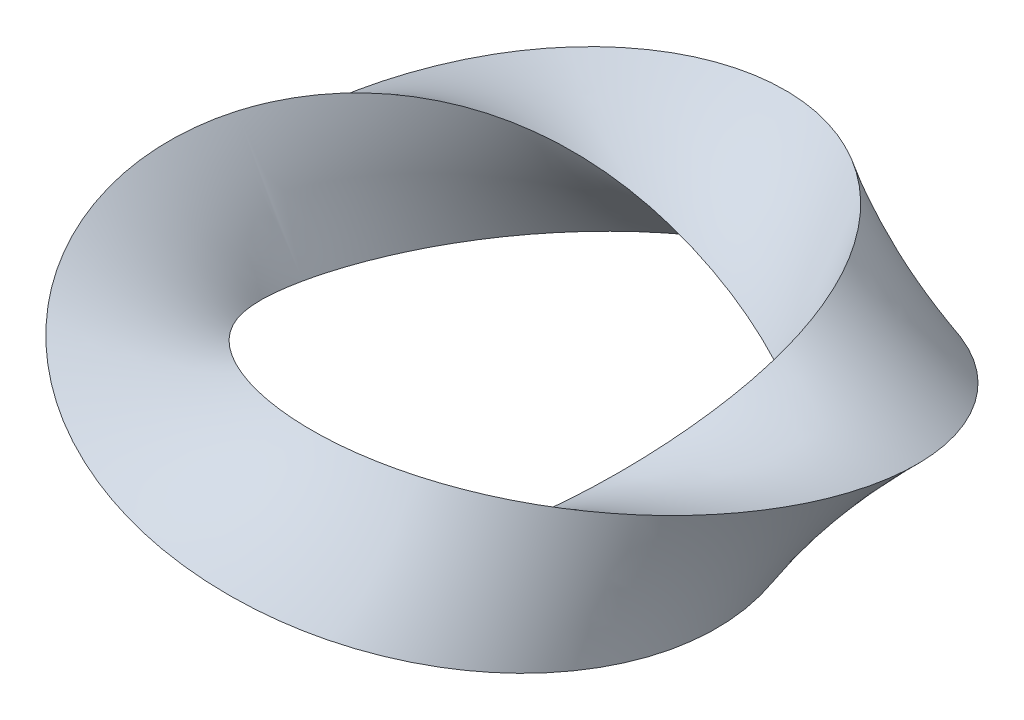
ISO-10303-21;
HEADER;
FILE_DESCRIPTION(('STEP AP214'),'2;1');
FILE_NAME('part.step','',(''),(''),'','','');
FILE_SCHEMA(('AUTOMOTIVE_DESIGN { 1 0 10303 214 1 1 1 1 }'));
ENDSEC;
DATA;
#1=APPLICATION_CONTEXT('core data for automotive mechanical design processes');
#2=APPLICATION_PROTOCOL_DEFINITION('international standard','automotive_design',2000,#1);
#3=PRODUCT_CONTEXT('',#1,'mechanical');
#4=PRODUCT('Part','Part','',(#3));
#5=PRODUCT_RELATED_PRODUCT_CATEGORY('part','',(#4));
#6=PRODUCT_DEFINITION_FORMATION('','',#4);
#7=PRODUCT_DEFINITION_CONTEXT('part definition',#1,'design');
#8=PRODUCT_DEFINITION('design','',#6,#7);
#9=PRODUCT_DEFINITION_SHAPE('','',#8);
#10=(LENGTH_UNIT() NAMED_UNIT(*) SI_UNIT(.MILLI.,.METRE.));
#11=(NAMED_UNIT(*) PLANE_ANGLE_UNIT() SI_UNIT($,.RADIAN.));
#12=(NAMED_UNIT(*) SI_UNIT($,.STERADIAN.) SOLID_ANGLE_UNIT());
#13=UNCERTAINTY_MEASURE_WITH_UNIT(LENGTH_MEASURE(1.E-05),#10,'distance_accuracy_value','');
#14=(GEOMETRIC_REPRESENTATION_CONTEXT(3) GLOBAL_UNCERTAINTY_ASSIGNED_CONTEXT((#13)) GLOBAL_UNIT_ASSIGNED_CONTEXT((#10,
#11,#12)) REPRESENTATION_CONTEXT('',''));
#15=CARTESIAN_POINT('',(0.,0.,0.));
#16=DIRECTION('',(0.,0.,1.));
#17=DIRECTION('',(1.,0.,0.));
#18=AXIS2_PLACEMENT_3D('',#15,#16,#17);
#19=CARTESIAN_POINT('',(-37.5,-4.33012701892219,0.));
#20=CARTESIAN_POINT('',(-36.9331876986768,-5.31187472316901,4.90873852123405));
#21=CARTESIAN_POINT('',(-35.1848968636041,-6.18053453575194,9.57655104048252));
#22=CARTESIAN_POINT('',(-29.9893137674932,-7.56074840163707,17.4194909198788));
#23=CARTESIAN_POINT('',(-26.5566893698285,-8.07175940025579,20.5881504869488));
#24=CARTESIAN_POINT('',(-19.0395904824421,-8.65856667450038,25.0081293653218));
#25=CARTESIAN_POINT('',(-14.9693914168101,-8.73413206677209,26.2642448082777));
#26=CARTESIAN_POINT('',(-7.12645148771719,-8.43819666125312,27.0798388038974));
#27=CARTESIAN_POINT('',(-3.36017840763648,-8.06681230123433,26.6516206846521));
#28=CARTESIAN_POINT('',(3.36017840763654,-6.93318769876564,24.6881252775034));
#29=CARTESIAN_POINT('',(6.31815324157185,-6.17139348863086,23.1649388714517));
#30=CARTESIAN_POINT('',(11.3842913807537,-4.37266375868246,19.5725430229252));
#31=CARTESIAN_POINT('',(13.5030858580376,-3.33643596123894,17.5081293968507));
#32=CARTESIAN_POINT('',(17.0931939942331,-1.14644139960124,13.0881504554199));
#33=CARTESIAN_POINT('',(18.5744138035498,0.00646369639998668,10.7277891975303));
#34=CARTESIAN_POINT('',(20.9931951097494,2.25431627003643,5.66165104503271));
#35=CARTESIAN_POINT('',(21.9331876990619,3.34837931485067,2.94524301827781));
#36=CARTESIAN_POINT('',(23.0668123009381,5.31187472299382,-2.94524301827782));
#37=CARTESIAN_POINT('',(23.2534636396127,6.18053453574113,-6.12832225505073));
#38=CARTESIAN_POINT('',(22.4378696306445,7.56074840164795,-12.7976476683988));
#39=CARTESIAN_POINT('',(21.4233209949543,8.07175940026838,-16.2846528906458));
#40=CARTESIAN_POINT('',(17.8332128951609,8.65856667448781,-22.9718809994693));
#41=CARTESIAN_POINT('',(15.247747171471,8.7341320667658,-26.1629385899118));
#42=CARTESIAN_POINT('',(8.57842180781251,8.4381966612594,-31.3585216992676));
#43=CARTESIAN_POINT('',(4.49380297309094,8.06681230122166,-33.3483793153453));
#44=CARTESIAN_POINT('',(-4.49380297309095,6.93318769877824,-35.3118747224993));
#45=CARTESIAN_POINT('',(-9.38672005392585,6.17139348865209,-35.2734216317438));
#46=CARTESIAN_POINT('',(-18.8328472075595,4.37266375866115,-32.8546403752338));
#47=CARTESIAN_POINT('',(-23.3697175195024,3.33643596125307,-30.4718809679666));
#48=CARTESIAN_POINT('',(-30.8868163706127,1.146441399587,-23.7846529221484));
#49=CARTESIAN_POINT('',(-33.8527695945879,-0.00646369638231939,-19.4893493908182));
#50=CARTESIAN_POINT('',(-37.4451653934674,-2.25431627005422,-10.0432222504294));
#51=CARTESIAN_POINT('',(-38.0668123013232,-3.34837931467538,-4.90873852123405));
#52=CARTESIAN_POINT('',(-37.5,-4.33012701892219,0.));
#53=CARTESIAN_POINT('',(-22.5,-4.33012701892219,0.));
#54=CARTESIAN_POINT('',(-21.9331876986768,-3.34837931467538,2.94524311274043));
#55=CARTESIAN_POINT('',(-20.993195109757,-2.25431627004797,5.66165104505008));
#56=CARTESIAN_POINT('',(-18.5744138035422,-0.00646369638831676,10.727789197513));
#57=CARTESIAN_POINT('',(-17.0931939941808,1.14644139960017,13.0881504554532));
#58=CARTESIAN_POINT('',(-13.5030858580899,3.33643596124013,17.5081293968174));
#59=CARTESIAN_POINT('',(-11.3842913807434,4.37266375866613,19.572543022935));
#60=CARTESIAN_POINT('',(-6.31815324158212,6.17139348864728,23.164938871442));
#61=CARTESIAN_POINT('',(-3.36017840763649,6.93318769877275,24.6881252775035));
#62=CARTESIAN_POINT('',(3.36017840763654,8.06681230122727,26.6516206846522));
#63=CARTESIAN_POINT('',(7.12645148770648,8.43819666125232,27.0798388039067));
#64=CARTESIAN_POINT('',(14.9693914168208,8.7341320667729,26.2642448082685));
#65=CARTESIAN_POINT('',(19.0395904823721,8.65856667448069,25.0081293653693));
#66=CARTESIAN_POINT('',(26.5566893698987,8.07175940027543,20.5881504869013));
#67=CARTESIAN_POINT('',(29.9893137674791,7.56074840163724,17.4194909199214));
#68=CARTESIAN_POINT('',(35.1848968636184,6.18053453575169,9.57655104043985));
#69=CARTESIAN_POINT('',(36.9331876990619,5.31187472299548,4.90873836245379));
#70=CARTESIAN_POINT('',(38.0668123009381,3.34837931484879,-4.9087383624538));
#71=CARTESIAN_POINT('',(37.4451653934532,2.25431627003276,-10.0432222504791));
#72=CARTESIAN_POINT('',(33.8527695946021,0.00646369640340365,-19.4893493907686));
#73=CARTESIAN_POINT('',(30.8868163706126,-1.14644139960136,-23.7846529221342));
#74=CARTESIAN_POINT('',(23.3697175195024,-3.33643596123906,-30.4718809679808));
#75=CARTESIAN_POINT('',(18.832847207524,-4.37266375866129,-32.854640375262));
#76=CARTESIAN_POINT('',(9.38672005396125,-6.17139348865223,-35.2734216317153));
#77=CARTESIAN_POINT('',(4.49380297309092,-6.93318769877833,-35.3118747224849));
#78=CARTESIAN_POINT('',(-4.49380297309092,-8.06681230122175,-33.3483793153593));
#79=CARTESIAN_POINT('',(-8.57842180779472,-8.43819666124524,-31.3585216993029));
#80=CARTESIAN_POINT('',(-15.2477471714887,-8.73413206678,-26.1629385898762));
#81=CARTESIAN_POINT('',(-17.8332128951608,-8.65856667448067,-22.971880999455));
#82=CARTESIAN_POINT('',(-21.4233209949541,-8.07175940027542,-16.2846528906598));
#83=CARTESIAN_POINT('',(-22.4378696306585,-7.56074840164252,-12.7976476684271));
#84=CARTESIAN_POINT('',(-23.2534636395984,-6.18053453574633,-6.12832225502227));
#85=CARTESIAN_POINT('',(-23.0668123013232,-5.311874723169,-2.94524311274043));
#86=CARTESIAN_POINT('',(-22.5,-4.33012701892219,0.));
#87=B_SPLINE_SURFACE_WITH_KNOTS('',1,3,((#19,#20,#21,#22,#23,#24,#25,#26,#27,#28,#29,#30,#31,
#32,#33,#34,#35,#36,#37,#38,#39,#40,#41,#42,#43,#44,#45,#46,#47,#48,#49,#50,#51,#52),(#53,#54,
#55,#56,#57,#58,#59,#60,#61,#62,#63,#64,#65,#66,#67,#68,#69,#70,#71,#72,#73,#74,#75,#76,#77,#78,
#79,#80,#81,#82,#83,#84,#85,#86)),.UNSPECIFIED.,.F.,.T.,.F.,(2,2),(4,2,2,2,2,2,2,2,2,2,2,2,2,2,
2,2,4),(0.,1.),(0.,0.0625,0.125,0.1875,0.25,0.3125,0.375,0.4375,0.5,0.5625,0.625,0.6875,0.75,
0.8125,0.875,0.9375,1.),.UNSPECIFIED.);
#88=DIRECTION('',(1.,0.,0.));
#89=VECTOR('',#88,1.);
#90=CARTESIAN_POINT('',(-37.5,-4.33012701892219,0.));
#91=LINE('',#90,#89);
#92=CARTESIAN_POINT('',(-37.5,-4.3301270189222,0.));
#93=VERTEX_POINT('',#92);
#94=CARTESIAN_POINT('',(-22.5,-4.33012701892219,0.));
#95=VERTEX_POINT('',#94);
#96=EDGE_CURVE('E40',#93,#95,#91,.T.);
#97=CARTESIAN_POINT('',(-37.5,-4.3301270189222,0.));
#98=CARTESIAN_POINT('',(-36.9331876986768,-5.31187472316901,4.90873852123405));
#99=CARTESIAN_POINT('',(-35.1848968636041,-6.18053453575195,9.57655104048252));
#100=CARTESIAN_POINT('',(-29.9893137674932,-7.56074840163707,17.4194909198788));
#101=CARTESIAN_POINT('',(-26.5566893698285,-8.07175940026288,20.5881504869488));
#102=CARTESIAN_POINT('',(-19.0395904824421,-8.6585666744933,25.0081293653218));
#103=CARTESIAN_POINT('',(-14.9693914168066,-8.73413206675791,26.2642448082706));
#104=CARTESIAN_POINT('',(-7.12645148772073,-8.43819666126731,27.0798388039044));
#105=CARTESIAN_POINT('',(-3.36017840763648,-8.06681230123433,26.6516206846663));
#106=CARTESIAN_POINT('',(3.36017840763654,-6.93318769876564,24.6881252774893));
#107=CARTESIAN_POINT('',(6.31815324157184,-6.17139348864504,23.1649388714517));
#108=CARTESIAN_POINT('',(11.3842913807536,-4.37266375866828,19.5725430229252));
#109=CARTESIAN_POINT('',(13.5030858580376,-3.33643596123894,17.5081293968436));
#110=CARTESIAN_POINT('',(17.0931939942331,-1.14644139960124,13.088150455427));
#111=CARTESIAN_POINT('',(18.5744138035498,0.00646369640353505,10.7277891975338));
#112=CARTESIAN_POINT('',(20.9931951097494,2.25431627003289,5.66165104502916));
#113=CARTESIAN_POINT('',(21.9331876990619,3.34837931485068,2.94524301827781));
#114=CARTESIAN_POINT('',(23.0668123009381,5.31187472299382,-2.94524301827782));
#115=CARTESIAN_POINT('',(23.2534636396127,6.18053453573404,-6.12832225505428));
#116=CARTESIAN_POINT('',(22.4378696306445,7.56074840165504,-12.7976476683953));
#117=CARTESIAN_POINT('',(21.4233209949543,8.07175940026838,-16.2846528906529));
#118=CARTESIAN_POINT('',(17.8332128951609,8.65856667448781,-22.9718809994622));
#119=CARTESIAN_POINT('',(15.2477471714675,8.7341320667658,-26.1629385898976));
#120=CARTESIAN_POINT('',(8.57842180781606,8.4381966612594,-31.3585216992818));
#121=CARTESIAN_POINT('',(4.49380297309094,8.06681230122166,-33.3483793153594));
#122=CARTESIAN_POINT('',(-4.49380297309095,6.93318769877824,-35.3118747224851));
#123=CARTESIAN_POINT('',(-9.38672005393294,6.17139348863791,-35.2734216317296));
#124=CARTESIAN_POINT('',(-18.8328472075524,4.37266375867533,-32.854640375248));
#125=CARTESIAN_POINT('',(-23.3697175195095,3.33643596125307,-30.4718809679595));
#126=CARTESIAN_POINT('',(-30.8868163706056,1.146441399587,-23.7846529221555));
#127=CARTESIAN_POINT('',(-33.8527695945879,-0.00646369638232286,-19.4893493908182));
#128=CARTESIAN_POINT('',(-37.4451653934674,-2.25431627005422,-10.0432222504294));
#129=CARTESIAN_POINT('',(-38.0668123013232,-3.34837931467538,-4.90873852123405));
#130=CARTESIAN_POINT('',(-37.5,-4.3301270189222,0.));
#131=B_SPLINE_CURVE_WITH_KNOTS('',3,(#97,#98,#99,#100,#101,#102,#103,#104,#105,#106,#107,#108,
#109,#110,#111,#112,#113,#114,#115,#116,#117,#118,#119,#120,#121,#122,#123,#124,#125,#126,#127,
#128,#129,#130),.UNSPECIFIED.,.T.,.F.,(4,2,2,2,2,2,2,2,2,2,2,2,2,2,2,2,4),(0.,0.0625,0.125,
0.1875,0.25,0.3125,0.375,0.4375,0.5,0.5625,0.625,0.6875,0.75,0.8125,0.875,0.9375,1.),.UNSPECIFIED.);
#132=EDGE_CURVE('E11',#93,#93,#131,.T.);
#133=CARTESIAN_POINT('',(-22.5,-4.33012701892219,0.));
#134=CARTESIAN_POINT('',(-21.9331876986768,-3.34837931467538,2.94524311274043));
#135=CARTESIAN_POINT('',(-20.993195109757,-2.25431627004797,5.66165104505008));
#136=CARTESIAN_POINT('',(-18.5744138035422,-0.00646369638831676,10.727789197513));
#137=CARTESIAN_POINT('',(-17.0931939941808,1.14644139960017,13.0881504554532));
#138=CARTESIAN_POINT('',(-13.5030858580899,3.33643596124013,17.5081293968174));
#139=CARTESIAN_POINT('',(-11.3842913807434,4.37266375866613,19.572543022935));
#140=CARTESIAN_POINT('',(-6.31815324158212,6.17139348864728,23.164938871442));
#141=CARTESIAN_POINT('',(-3.36017840763649,6.93318769877275,24.6881252775035));
#142=CARTESIAN_POINT('',(3.36017840763654,8.06681230122727,26.6516206846522));
#143=CARTESIAN_POINT('',(7.12645148770648,8.43819666125232,27.0798388039067));
#144=CARTESIAN_POINT('',(14.9693914168208,8.7341320667729,26.2642448082685));
#145=CARTESIAN_POINT('',(19.0395904823721,8.65856667448069,25.0081293653693));
#146=CARTESIAN_POINT('',(26.5566893698987,8.07175940027543,20.5881504869013));
#147=CARTESIAN_POINT('',(29.9893137674791,7.56074840163724,17.4194909199214));
#148=CARTESIAN_POINT('',(35.1848968636184,6.18053453575169,9.57655104043985));
#149=CARTESIAN_POINT('',(36.9331876990619,5.31187472299548,4.90873836245379));
#150=CARTESIAN_POINT('',(38.0668123009381,3.34837931484879,-4.9087383624538));
#151=CARTESIAN_POINT('',(37.4451653934532,2.25431627003276,-10.0432222504791));
#152=CARTESIAN_POINT('',(33.8527695946021,0.00646369640340365,-19.4893493907686));
#153=CARTESIAN_POINT('',(30.8868163706126,-1.14644139960136,-23.7846529221342));
#154=CARTESIAN_POINT('',(23.3697175195024,-3.33643596123906,-30.4718809679808));
#155=CARTESIAN_POINT('',(18.832847207524,-4.37266375866129,-32.854640375262));
#156=CARTESIAN_POINT('',(9.38672005396125,-6.17139348865223,-35.2734216317153));
#157=CARTESIAN_POINT('',(4.49380297309092,-6.93318769877833,-35.3118747224849));
#158=CARTESIAN_POINT('',(-4.49380297309092,-8.06681230122175,-33.3483793153593));
#159=CARTESIAN_POINT('',(-8.57842180779472,-8.43819666124524,-31.3585216993029));
#160=CARTESIAN_POINT('',(-15.2477471714887,-8.73413206678,-26.1629385898762));
#161=CARTESIAN_POINT('',(-17.8332128951608,-8.65856667448067,-22.971880999455));
#162=CARTESIAN_POINT('',(-21.4233209949541,-8.07175940027542,-16.2846528906598));
#163=CARTESIAN_POINT('',(-22.4378696306585,-7.56074840164252,-12.7976476684271));
#164=CARTESIAN_POINT('',(-23.2534636395984,-6.18053453574633,-6.12832225502227));
#165=CARTESIAN_POINT('',(-23.0668123013232,-5.311874723169,-2.94524311274043));
#166=CARTESIAN_POINT('',(-22.5,-4.33012701892219,0.));
#167=B_SPLINE_CURVE_WITH_KNOTS('',3,(#133,#134,#135,#136,#137,#138,#139,#140,#141,#142,#143,
#144,#145,#146,#147,#148,#149,#150,#151,#152,#153,#154,#155,#156,#157,#158,#159,#160,#161,#162,
#163,#164,#165,#166),.UNSPECIFIED.,.T.,.F.,(4,2,2,2,2,2,2,2,2,2,2,2,2,2,2,2,4),(0.,0.0625,0.125,
0.1875,0.25,0.3125,0.375,0.4375,0.5,0.5625,0.625,0.6875,0.75,0.8125,0.875,0.9375,1.),.UNSPECIFIED.);
#168=EDGE_CURVE('E63',#95,#95,#167,.T.);
#169=ORIENTED_EDGE('',*,*,#96,.F.);
#170=ORIENTED_EDGE('',*,*,#132,.F.);
#171=ORIENTED_EDGE('',*,*,#96,.T.);
#172=ORIENTED_EDGE('',*,*,#168,.T.);
#173=EDGE_LOOP('',(#169,#170,#171,#172));
#174=FACE_BOUND('',#173,.T.);
#175=ADVANCED_FACE('F35',(#174),#87,.T.);
#176=CARTESIAN_POINT('',(-30.,8.66025403784438,0.));
#177=CARTESIAN_POINT('',(-31.1336246026464,8.66025403784438,3.92699081698724));
#178=CARTESIAN_POINT('',(-31.4794487814466,8.43485080578928,8.31910785776257));
#179=CARTESIAN_POINT('',(-30.0770475261886,7.56721209803602,17.1784277650293));
#180=CARTESIAN_POINT('',(-28.3201321831041,6.92531800067688,21.632904124049));
#181=CARTESIAN_POINT('',(-22.7665287259332,5.32213071323898,29.4537567849882));
#182=CARTESIAN_POINT('',(-18.972025084903,4.36146830812723,32.8039872660183));
#183=CARTESIAN_POINT('',(-10.1127052139604,2.26680317258456,37.4127630794612));
#184=CARTESIAN_POINT('',(-5.060615255919,1.13362460245448,38.6602540378444));
#185=CARTESIAN_POINT('',(5.06061525591908,-1.13362460245455,38.6602540378444));
#186=CARTESIAN_POINT('',(10.1127052139469,-2.26680317260019,37.4127630794454));
#187=CARTESIAN_POINT('',(18.9720250849164,-4.36146830811172,32.8039872660341));
#188=CARTESIAN_POINT('',(22.7665287258401,-5.32213071324884,29.4537567850307));
#189=CARTESIAN_POINT('',(28.3201321831971,-6.92531800066711,21.6329041240064));
#190=CARTESIAN_POINT('',(30.0770475261564,-7.56721209803722,17.1784277650675));
#191=CARTESIAN_POINT('',(31.4794487814787,-8.43485080578812,8.31910785772419));
#192=CARTESIAN_POINT('',(31.133624601869,-8.66025403784438,3.92699069036579));
#193=CARTESIAN_POINT('',(28.8663753981308,-8.66025403784438,-3.9269906903658));
#194=CARTESIAN_POINT('',(26.9589117217521,-8.43485080579871,-7.38576543776631));
#195=CARTESIAN_POINT('',(22.350135871967,-7.56721209802655,-13.0387108232526));
#196=CARTESIAN_POINT('',(19.6598781816627,-6.92531800066703,-15.2398992535477));
#197=CARTESIAN_POINT('',(14.1062746516857,-5.32213071324875,-18.5262535798007));
#198=CARTESIAN_POINT('',(11.2451135033896,-4.36146830813996,-19.6231961321531));
#199=CARTESIAN_POINT('',(5.59216808155785,-2.26680317257171,-21.0255974237216));
#200=CARTESIAN_POINT('',(2.79336612483385,-1.13362460244333,-21.3397459621556));
#201=CARTESIAN_POINT('',(-2.79336612483386,1.13362460244351,-21.3397459621556));
#202=CARTESIAN_POINT('',(-5.5921680815508,2.26680317257897,-21.025597423743));
#203=CARTESIAN_POINT('',(-11.2451135033967,4.36146830813304,-19.6231961321319));
#204=CARTESIAN_POINT('',(-14.1062746516858,5.32213071325598,-18.5262535797937));
#205=CARTESIAN_POINT('',(-19.6598781816628,6.92531800066007,-15.2398992535549));
#206=CARTESIAN_POINT('',(-22.3501358719601,7.56721209803016,-13.0387108232774));
#207=CARTESIAN_POINT('',(-26.9589117217594,8.43485080579524,-7.38576543774151));
#208=CARTESIAN_POINT('',(-28.8663753973536,8.66025403784438,-3.92699081698724));
#209=CARTESIAN_POINT('',(-30.,8.66025403784438,0.));
#210=CARTESIAN_POINT('',(-37.5,-4.3301270189222,0.));
#211=CARTESIAN_POINT('',(-36.9331876986768,-5.31187472316901,4.90873852123405));
#212=CARTESIAN_POINT('',(-35.1848968636041,-6.18053453575195,9.57655104048252));
#213=CARTESIAN_POINT('',(-29.9893137674932,-7.56074840163707,17.4194909198788));
#214=CARTESIAN_POINT('',(-26.5566893698285,-8.07175940026288,20.5881504869488));
#215=CARTESIAN_POINT('',(-19.0395904824421,-8.6585666744933,25.0081293653218));
#216=CARTESIAN_POINT('',(-14.9693914168066,-8.73413206675791,26.2642448082706));
#217=CARTESIAN_POINT('',(-7.12645148772073,-8.43819666126731,27.0798388039044));
#218=CARTESIAN_POINT('',(-3.36017840763648,-8.06681230123433,26.6516206846663));
#219=CARTESIAN_POINT('',(3.36017840763654,-6.93318769876564,24.6881252774893));
#220=CARTESIAN_POINT('',(6.31815324157184,-6.17139348864504,23.1649388714517));
#221=CARTESIAN_POINT('',(11.3842913807536,-4.37266375866828,19.5725430229252));
#222=CARTESIAN_POINT('',(13.5030858580376,-3.33643596123894,17.5081293968436));
#223=CARTESIAN_POINT('',(17.0931939942331,-1.14644139960124,13.088150455427));
#224=CARTESIAN_POINT('',(18.5744138035498,0.00646369640353505,10.7277891975338));
#225=CARTESIAN_POINT('',(20.9931951097494,2.25431627003289,5.66165104502916));
#226=CARTESIAN_POINT('',(21.9331876990619,3.34837931485068,2.94524301827781));
#227=CARTESIAN_POINT('',(23.0668123009381,5.31187472299382,-2.94524301827782));
#228=CARTESIAN_POINT('',(23.2534636396127,6.18053453573404,-6.12832225505428));
#229=CARTESIAN_POINT('',(22.4378696306445,7.56074840165504,-12.7976476683953));
#230=CARTESIAN_POINT('',(21.4233209949543,8.07175940026838,-16.2846528906529));
#231=CARTESIAN_POINT('',(17.8332128951609,8.65856667448781,-22.9718809994622));
#232=CARTESIAN_POINT('',(15.2477471714675,8.7341320667658,-26.1629385898976));
#233=CARTESIAN_POINT('',(8.57842180781606,8.4381966612594,-31.3585216992818));
#234=CARTESIAN_POINT('',(4.49380297309094,8.06681230122166,-33.3483793153594));
#235=CARTESIAN_POINT('',(-4.49380297309095,6.93318769877824,-35.3118747224851));
#236=CARTESIAN_POINT('',(-9.38672005393294,6.17139348863791,-35.2734216317296));
#237=CARTESIAN_POINT('',(-18.8328472075524,4.37266375867533,-32.854640375248));
#238=CARTESIAN_POINT('',(-23.3697175195095,3.33643596125307,-30.4718809679595));
#239=CARTESIAN_POINT('',(-30.8868163706056,1.146441399587,-23.7846529221555));
#240=CARTESIAN_POINT('',(-33.8527695945879,-0.00646369638232286,-19.4893493908182));
#241=CARTESIAN_POINT('',(-37.4451653934674,-2.25431627005422,-10.0432222504294));
#242=CARTESIAN_POINT('',(-38.0668123013232,-3.34837931467538,-4.90873852123405));
#243=CARTESIAN_POINT('',(-37.5,-4.3301270189222,0.));
#244=B_SPLINE_SURFACE_WITH_KNOTS('',1,3,((#176,#177,#178,#179,#180,#181,#182,#183,#184,#185,
#186,#187,#188,#189,#190,#191,#192,#193,#194,#195,#196,#197,#198,#199,#200,#201,#202,#203,#204,
#205,#206,#207,#208,#209),(#210,#211,#212,#213,#214,#215,#216,#217,#218,#219,#220,#221,#222,
#223,#224,#225,#226,#227,#228,#229,#230,#231,#232,#233,#234,#235,#236,#237,#238,#239,#240,#241,
#242,#243)),.UNSPECIFIED.,.F.,.T.,.F.,(2,2),(4,2,2,2,2,2,2,2,2,2,2,2,2,2,2,2,4),(0.,1.),(0.,
0.0625,0.125,0.1875,0.25,0.3125,0.375,0.4375,0.5,0.5625,0.625,0.6875,0.75,0.8125,0.875,0.9375,
1.),.UNSPECIFIED.);
#245=DIRECTION('',(-0.5,-0.866025403784439,0.));
#246=VECTOR('',#245,1.);
#247=CARTESIAN_POINT('',(-30.,8.66025403784438,0.));
#248=LINE('',#247,#246);
#249=CARTESIAN_POINT('',(-30.,8.66025403784438,0.));
#250=VERTEX_POINT('',#249);
#251=EDGE_CURVE('E66',#250,#93,#248,.T.);
#252=CARTESIAN_POINT('',(-30.,8.66025403784438,0.));
#253=CARTESIAN_POINT('',(-31.1336246026464,8.66025403784438,3.92699081698724));
#254=CARTESIAN_POINT('',(-31.4794487814466,8.43485080578928,8.31910785776257));
#255=CARTESIAN_POINT('',(-30.0770475261886,7.56721209803602,17.1784277650293));
#256=CARTESIAN_POINT('',(-28.3201321831041,6.92531800067688,21.632904124049));
#257=CARTESIAN_POINT('',(-22.7665287259332,5.32213071323898,29.4537567849882));
#258=CARTESIAN_POINT('',(-18.972025084903,4.36146830812723,32.8039872660183));
#259=CARTESIAN_POINT('',(-10.1127052139604,2.26680317258456,37.4127630794612));
#260=CARTESIAN_POINT('',(-5.060615255919,1.13362460245448,38.6602540378444));
#261=CARTESIAN_POINT('',(5.06061525591908,-1.13362460245455,38.6602540378444));
#262=CARTESIAN_POINT('',(10.1127052139469,-2.26680317260019,37.4127630794454));
#263=CARTESIAN_POINT('',(18.9720250849164,-4.36146830811172,32.8039872660341));
#264=CARTESIAN_POINT('',(22.7665287258401,-5.32213071324884,29.4537567850307));
#265=CARTESIAN_POINT('',(28.3201321831971,-6.92531800066711,21.6329041240064));
#266=CARTESIAN_POINT('',(30.0770475261564,-7.56721209803722,17.1784277650675));
#267=CARTESIAN_POINT('',(31.4794487814787,-8.43485080578812,8.31910785772419));
#268=CARTESIAN_POINT('',(31.133624601869,-8.66025403784438,3.92699069036579));
#269=CARTESIAN_POINT('',(28.8663753981308,-8.66025403784438,-3.9269906903658));
#270=CARTESIAN_POINT('',(26.9589117217521,-8.43485080579871,-7.38576543776631));
#271=CARTESIAN_POINT('',(22.350135871967,-7.56721209802655,-13.0387108232526));
#272=CARTESIAN_POINT('',(19.6598781816627,-6.92531800066703,-15.2398992535477));
#273=CARTESIAN_POINT('',(14.1062746516857,-5.32213071324875,-18.5262535798007));
#274=CARTESIAN_POINT('',(11.2451135033896,-4.36146830813996,-19.6231961321531));
#275=CARTESIAN_POINT('',(5.59216808155785,-2.26680317257171,-21.0255974237216));
#276=CARTESIAN_POINT('',(2.79336612483385,-1.13362460244333,-21.3397459621556));
#277=CARTESIAN_POINT('',(-2.79336612483386,1.13362460244351,-21.3397459621556));
#278=CARTESIAN_POINT('',(-5.5921680815508,2.26680317257897,-21.025597423743));
#279=CARTESIAN_POINT('',(-11.2451135033967,4.36146830813304,-19.6231961321319));
#280=CARTESIAN_POINT('',(-14.1062746516858,5.32213071325598,-18.5262535797937));
#281=CARTESIAN_POINT('',(-19.6598781816628,6.92531800066007,-15.2398992535549));
#282=CARTESIAN_POINT('',(-22.3501358719601,7.56721209803016,-13.0387108232774));
#283=CARTESIAN_POINT('',(-26.9589117217594,8.43485080579524,-7.38576543774151));
#284=CARTESIAN_POINT('',(-28.8663753973536,8.66025403784438,-3.92699081698724));
#285=CARTESIAN_POINT('',(-30.,8.66025403784438,0.));
#286=B_SPLINE_CURVE_WITH_KNOTS('',3,(#252,#253,#254,#255,#256,#257,#258,#259,#260,#261,#262,
#263,#264,#265,#266,#267,#268,#269,#270,#271,#272,#273,#274,#275,#276,#277,#278,#279,#280,#281,
#282,#283,#284,#285),.UNSPECIFIED.,.T.,.F.,(4,2,2,2,2,2,2,2,2,2,2,2,2,2,2,2,4),(0.,0.0625,0.125,
0.1875,0.25,0.3125,0.375,0.4375,0.5,0.5625,0.625,0.6875,0.75,0.8125,0.875,0.9375,1.),.UNSPECIFIED.);
#287=EDGE_CURVE('E45',#250,#250,#286,.T.);
#288=ORIENTED_EDGE('',*,*,#251,.F.);
#289=ORIENTED_EDGE('',*,*,#287,.F.);
#290=ORIENTED_EDGE('',*,*,#251,.T.);
#291=ORIENTED_EDGE('',*,*,#132,.T.);
#292=EDGE_LOOP('',(#288,#289,#290,#291));
#293=FACE_BOUND('',#292,.T.);
#294=ADVANCED_FACE('F84',(#293),#244,.T.);
#295=CARTESIAN_POINT('',(-22.5,-4.33012701892219,0.));
#296=CARTESIAN_POINT('',(-21.9331876986768,-3.34837931467538,2.94524311274043));
#297=CARTESIAN_POINT('',(-20.993195109757,-2.25431627004797,5.66165104505008));
#298=CARTESIAN_POINT('',(-18.5744138035422,-0.00646369638831676,10.727789197513));
#299=CARTESIAN_POINT('',(-17.0931939941808,1.14644139960017,13.0881504554532));
#300=CARTESIAN_POINT('',(-13.5030858580899,3.33643596124013,17.5081293968174));
#301=CARTESIAN_POINT('',(-11.3842913807434,4.37266375866613,19.572543022935));
#302=CARTESIAN_POINT('',(-6.31815324158212,6.17139348864728,23.164938871442));
#303=CARTESIAN_POINT('',(-3.36017840763649,6.93318769877275,24.6881252775035));
#304=CARTESIAN_POINT('',(3.36017840763654,8.06681230122727,26.6516206846522));
#305=CARTESIAN_POINT('',(7.12645148770648,8.43819666125232,27.0798388039067));
#306=CARTESIAN_POINT('',(14.9693914168208,8.7341320667729,26.2642448082685));
#307=CARTESIAN_POINT('',(19.0395904823721,8.65856667448069,25.0081293653693));
#308=CARTESIAN_POINT('',(26.5566893698987,8.07175940027543,20.5881504869013));
#309=CARTESIAN_POINT('',(29.9893137674791,7.56074840163724,17.4194909199214));
#310=CARTESIAN_POINT('',(35.1848968636184,6.18053453575169,9.57655104043985));
#311=CARTESIAN_POINT('',(36.9331876990619,5.31187472299548,4.90873836245379));
#312=CARTESIAN_POINT('',(38.0668123009381,3.34837931484879,-4.9087383624538));
#313=CARTESIAN_POINT('',(37.4451653934532,2.25431627003276,-10.0432222504791));
#314=CARTESIAN_POINT('',(33.8527695946021,0.00646369640340365,-19.4893493907686));
#315=CARTESIAN_POINT('',(30.8868163706126,-1.14644139960136,-23.7846529221342));
#316=CARTESIAN_POINT('',(23.3697175195024,-3.33643596123906,-30.4718809679808));
#317=CARTESIAN_POINT('',(18.832847207524,-4.37266375866129,-32.854640375262));
#318=CARTESIAN_POINT('',(9.38672005396125,-6.17139348865223,-35.2734216317153));
#319=CARTESIAN_POINT('',(4.49380297309092,-6.93318769877833,-35.3118747224849));
#320=CARTESIAN_POINT('',(-4.49380297309092,-8.06681230122175,-33.3483793153593));
#321=CARTESIAN_POINT('',(-8.57842180779472,-8.43819666124524,-31.3585216993029));
#322=CARTESIAN_POINT('',(-15.2477471714887,-8.73413206678,-26.1629385898762));
#323=CARTESIAN_POINT('',(-17.8332128951608,-8.65856667448067,-22.971880999455));
#324=CARTESIAN_POINT('',(-21.4233209949541,-8.07175940027542,-16.2846528906598));
#325=CARTESIAN_POINT('',(-22.4378696306585,-7.56074840164252,-12.7976476684271));
#326=CARTESIAN_POINT('',(-23.2534636395984,-6.18053453574633,-6.12832225502227));
#327=CARTESIAN_POINT('',(-23.0668123013232,-5.311874723169,-2.94524311274043));
#328=CARTESIAN_POINT('',(-22.5,-4.33012701892219,0.));
#329=CARTESIAN_POINT('',(-30.,8.66025403784438,0.));
#330=CARTESIAN_POINT('',(-31.1336246026464,8.66025403784438,3.92699081698724));
#331=CARTESIAN_POINT('',(-31.4794487814466,8.43485080578928,8.31910785776257));
#332=CARTESIAN_POINT('',(-30.0770475261886,7.56721209803602,17.1784277650293));
#333=CARTESIAN_POINT('',(-28.3201321831041,6.92531800067688,21.632904124049));
#334=CARTESIAN_POINT('',(-22.7665287259332,5.32213071323898,29.4537567849882));
#335=CARTESIAN_POINT('',(-18.972025084903,4.36146830812723,32.8039872660183));
#336=CARTESIAN_POINT('',(-10.1127052139604,2.26680317258456,37.4127630794612));
#337=CARTESIAN_POINT('',(-5.060615255919,1.13362460245448,38.6602540378444));
#338=CARTESIAN_POINT('',(5.06061525591908,-1.13362460245455,38.6602540378444));
#339=CARTESIAN_POINT('',(10.1127052139469,-2.26680317260019,37.4127630794454));
#340=CARTESIAN_POINT('',(18.9720250849164,-4.36146830811172,32.8039872660341));
#341=CARTESIAN_POINT('',(22.7665287258401,-5.32213071324884,29.4537567850307));
#342=CARTESIAN_POINT('',(28.3201321831971,-6.92531800066711,21.6329041240064));
#343=CARTESIAN_POINT('',(30.0770475261564,-7.56721209803722,17.1784277650675));
#344=CARTESIAN_POINT('',(31.4794487814787,-8.43485080578812,8.31910785772419));
#345=CARTESIAN_POINT('',(31.133624601869,-8.66025403784438,3.92699069036579));
#346=CARTESIAN_POINT('',(28.8663753981308,-8.66025403784438,-3.9269906903658));
#347=CARTESIAN_POINT('',(26.9589117217521,-8.43485080579871,-7.38576543776631));
#348=CARTESIAN_POINT('',(22.350135871967,-7.56721209802655,-13.0387108232526));
#349=CARTESIAN_POINT('',(19.6598781816627,-6.92531800066703,-15.2398992535477));
#350=CARTESIAN_POINT('',(14.1062746516857,-5.32213071324875,-18.5262535798007));
#351=CARTESIAN_POINT('',(11.2451135033896,-4.36146830813996,-19.6231961321531));
#352=CARTESIAN_POINT('',(5.59216808155785,-2.26680317257171,-21.0255974237216));
#353=CARTESIAN_POINT('',(2.79336612483385,-1.13362460244333,-21.3397459621556));
#354=CARTESIAN_POINT('',(-2.79336612483386,1.13362460244351,-21.3397459621556));
#355=CARTESIAN_POINT('',(-5.5921680815508,2.26680317257897,-21.025597423743));
#356=CARTESIAN_POINT('',(-11.2451135033967,4.36146830813304,-19.6231961321319));
#357=CARTESIAN_POINT('',(-14.1062746516858,5.32213071325598,-18.5262535797937));
#358=CARTESIAN_POINT('',(-19.6598781816628,6.92531800066007,-15.2398992535549));
#359=CARTESIAN_POINT('',(-22.3501358719601,7.56721209803016,-13.0387108232774));
#360=CARTESIAN_POINT('',(-26.9589117217594,8.43485080579524,-7.38576543774151));
#361=CARTESIAN_POINT('',(-28.8663753973536,8.66025403784438,-3.92699081698724));
#362=CARTESIAN_POINT('',(-30.,8.66025403784438,0.));
#363=B_SPLINE_SURFACE_WITH_KNOTS('',1,3,((#295,#296,#297,#298,#299,#300,#301,#302,#303,#304,
#305,#306,#307,#308,#309,#310,#311,#312,#313,#314,#315,#316,#317,#318,#319,#320,#321,#322,#323,
#324,#325,#326,#327,#328),(#329,#330,#331,#332,#333,#334,#335,#336,#337,#338,#339,#340,#341,
#342,#343,#344,#345,#346,#347,#348,#349,#350,#351,#352,#353,#354,#355,#356,#357,#358,#359,#360,
#361,#362)),.UNSPECIFIED.,.F.,.T.,.F.,(2,2),(4,2,2,2,2,2,2,2,2,2,2,2,2,2,2,2,4),(0.,1.),(0.,
0.0625,0.125,0.1875,0.25,0.3125,0.375,0.4375,0.5,0.5625,0.625,0.6875,0.75,0.8125,0.875,0.9375,
1.),.UNSPECIFIED.);
#364=DIRECTION('',(-0.5,0.866025403784439,0.));
#365=VECTOR('',#364,1.);
#366=CARTESIAN_POINT('',(-22.5,-4.33012701892219,0.));
#367=LINE('',#366,#365);
#368=EDGE_CURVE('E76',#95,#250,#367,.T.);
#369=ORIENTED_EDGE('',*,*,#368,.F.);
#370=ORIENTED_EDGE('',*,*,#168,.F.);
#371=ORIENTED_EDGE('',*,*,#368,.T.);
#372=ORIENTED_EDGE('',*,*,#287,.T.);
#373=EDGE_LOOP('',(#369,#370,#371,#372));
#374=FACE_BOUND('',#373,.T.);
#375=ADVANCED_FACE('F82',(#374),#363,.T.);
#376=CLOSED_SHELL('',(#175,#294,#375));
#377=MANIFOLD_SOLID_BREP('B2',#376);
#378=ADVANCED_BREP_SHAPE_REPRESENTATION('',(#18,#377),#14);
#379=SHAPE_DEFINITION_REPRESENTATION(#9,#378);
ENDSEC;
END-ISO-10303-21;
